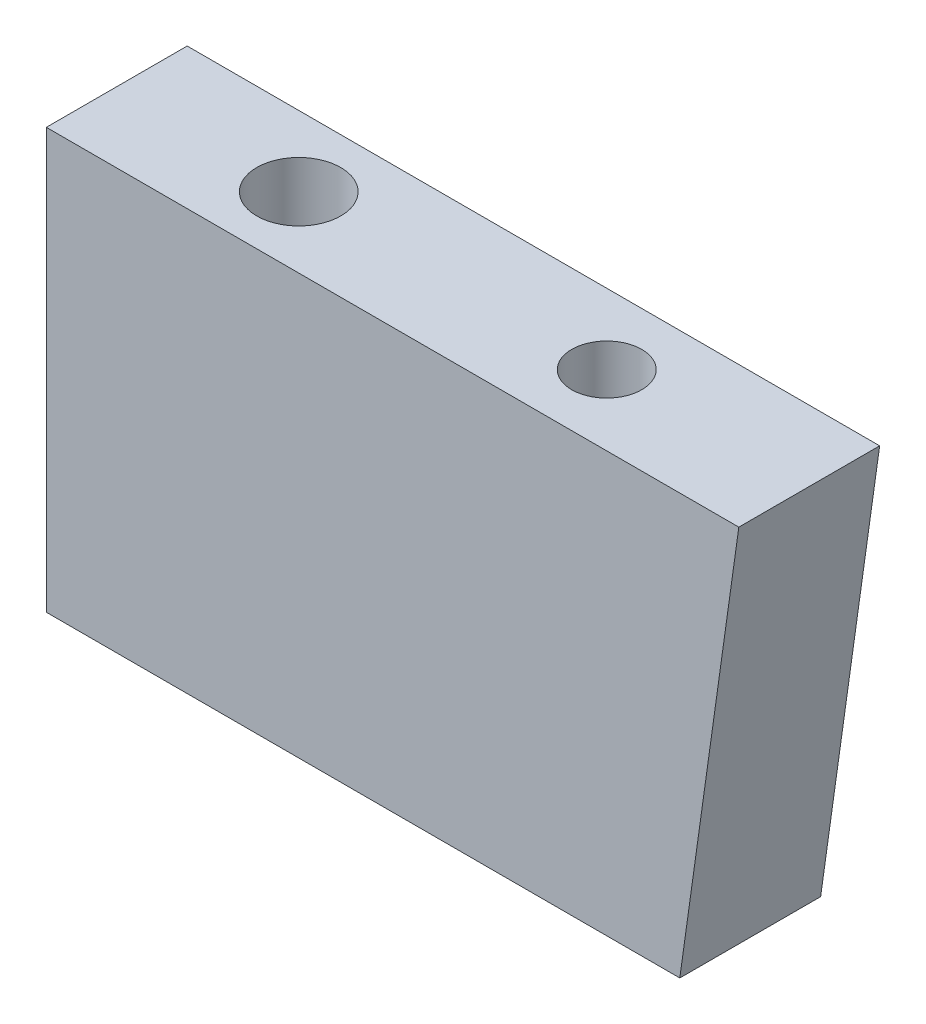
ISO-10303-21;
HEADER;
FILE_DESCRIPTION(('STEP AP214'),'2;1');
FILE_NAME('part.step','',(''),(''),'','','');
FILE_SCHEMA(('AUTOMOTIVE_DESIGN { 1 0 10303 214 1 1 1 1 }'));
ENDSEC;
DATA;
#1=APPLICATION_CONTEXT('core data for automotive mechanical design processes');
#2=APPLICATION_PROTOCOL_DEFINITION('international standard','automotive_design',2000,#1);
#3=PRODUCT_CONTEXT('',#1,'mechanical');
#4=PRODUCT('Part','Part','',(#3));
#5=PRODUCT_RELATED_PRODUCT_CATEGORY('part','',(#4));
#6=PRODUCT_DEFINITION_FORMATION('','',#4);
#7=PRODUCT_DEFINITION_CONTEXT('part definition',#1,'design');
#8=PRODUCT_DEFINITION('design','',#6,#7);
#9=PRODUCT_DEFINITION_SHAPE('','',#8);
#10=(LENGTH_UNIT() NAMED_UNIT(*) SI_UNIT(.MILLI.,.METRE.));
#11=(NAMED_UNIT(*) PLANE_ANGLE_UNIT() SI_UNIT($,.RADIAN.));
#12=(NAMED_UNIT(*) SI_UNIT($,.STERADIAN.) SOLID_ANGLE_UNIT());
#13=UNCERTAINTY_MEASURE_WITH_UNIT(LENGTH_MEASURE(1.E-05),#10,'distance_accuracy_value','');
#14=(GEOMETRIC_REPRESENTATION_CONTEXT(3) GLOBAL_UNCERTAINTY_ASSIGNED_CONTEXT((#13)) GLOBAL_UNIT_ASSIGNED_CONTEXT((#10,
#11,#12)) REPRESENTATION_CONTEXT('',''));
#15=CARTESIAN_POINT('',(0.,0.,0.));
#16=DIRECTION('',(0.,0.,1.));
#17=DIRECTION('',(1.,0.,0.));
#18=AXIS2_PLACEMENT_3D('',#15,#16,#17);
#19=CARTESIAN_POINT('',(29.2324936180977,208.,2.51500000000003));
#20=DIRECTION('',(-0.99026806874159,0.139173100960068,0.));
#21=DIRECTION('',(-0.139173100960066,-0.990268068741571,0.));
#22=AXIS2_PLACEMENT_3D('',#19,#20,#21);
#23=PLANE('',#22);
#24=DIRECTION('',(0.139173100960066,0.990268068741571,0.));
#25=VECTOR('',#24,1.);
#26=CARTESIAN_POINT('',(29.2324936180977,208.,2.51500000000003));
#27=LINE('',#26,#25);
#28=CARTESIAN_POINT('',(27.1243810975619,193.,2.51500000000003));
#29=VERTEX_POINT('',#28);
#30=CARTESIAN_POINT('',(29.2324936180977,208.,2.51500000000003));
#31=VERTEX_POINT('',#30);
#32=EDGE_CURVE('E84',#29,#31,#27,.T.);
#33=ORIENTED_EDGE('',*,*,#32,.F.);
#34=DIRECTION('',(0.,0.,1.00000000000001));
#35=VECTOR('',#34,1.);
#36=CARTESIAN_POINT('',(27.1243810975619,193.,-2.515));
#37=LINE('',#36,#35);
#38=CARTESIAN_POINT('',(27.1243810975619,193.,-2.515));
#39=VERTEX_POINT('',#38);
#40=EDGE_CURVE('E97',#39,#29,#37,.T.);
#41=ORIENTED_EDGE('',*,*,#40,.F.);
#42=DIRECTION('',(0.139173100960066,0.990268068741571,0.));
#43=VECTOR('',#42,1.);
#44=CARTESIAN_POINT('',(29.2324936180977,208.,-2.515));
#45=LINE('',#44,#43);
#46=CARTESIAN_POINT('',(29.2324936180977,208.,-2.515));
#47=VERTEX_POINT('',#46);
#48=EDGE_CURVE('E76',#39,#47,#45,.T.);
#49=ORIENTED_EDGE('',*,*,#48,.T.);
#50=DIRECTION('',(0.,0.,-1.00000000000001));
#51=VECTOR('',#50,1.);
#52=CARTESIAN_POINT('',(29.2324936180977,208.,2.51500000000003));
#53=LINE('',#52,#51);
#54=EDGE_CURVE('E11',#31,#47,#53,.T.);
#55=ORIENTED_EDGE('',*,*,#54,.F.);
#56=EDGE_LOOP('',(#33,#41,#49,#55));
#57=FACE_BOUND('',#56,.T.);
#58=ADVANCED_FACE('F32',(#57),#23,.F.);
#59=CARTESIAN_POINT('',(29.2324936180977,208.,2.51500000000003));
#60=DIRECTION('',(0.,-1.,0.));
#61=DIRECTION('',(0.,0.,-1.00000000000001));
#62=AXIS2_PLACEMENT_3D('',#59,#60,#61);
#63=PLANE('',#62);
#64=CARTESIAN_POINT('',(21.9999999999999,208.,0.));
#65=DIRECTION('',(0.,1.,0.));
#66=DIRECTION('',(0.,0.,1.00000000000001));
#67=AXIS2_PLACEMENT_3D('',#64,#65,#66);
#68=CIRCLE('',#67,1.24999999999999);
#69=CARTESIAN_POINT('',(21.9999999999999,208.,1.25000000000002));
#70=VERTEX_POINT('',#69);
#71=EDGE_CURVE('E113',#70,#70,#68,.T.);
#72=ORIENTED_EDGE('',*,*,#71,.F.);
#73=EDGE_LOOP('',(#72));
#74=FACE_BOUND('',#73,.T.);
#75=CARTESIAN_POINT('',(10.9999999999998,208.,0.));
#76=DIRECTION('',(0.,1.,0.));
#77=DIRECTION('',(0.,0.,1.00000000000001));
#78=AXIS2_PLACEMENT_3D('',#75,#76,#77);
#79=CIRCLE('',#78,1.5);
#80=CARTESIAN_POINT('',(10.9999999999998,208.,1.50000000000006));
#81=VERTEX_POINT('',#80);
#82=EDGE_CURVE('E107',#81,#81,#79,.T.);
#83=ORIENTED_EDGE('',*,*,#82,.F.);
#84=EDGE_LOOP('',(#83));
#85=FACE_BOUND('',#84,.T.);
#86=DIRECTION('',(-1.00000000000002,0.,0.));
#87=VECTOR('',#86,1.);
#88=CARTESIAN_POINT('',(29.2324936180977,208.,-2.515));
#89=LINE('',#88,#87);
#90=CARTESIAN_POINT('',(4.49999999999969,208.,-2.51499999999994));
#91=VERTEX_POINT('',#90);
#92=EDGE_CURVE('E67',#47,#91,#89,.T.);
#93=ORIENTED_EDGE('',*,*,#92,.T.);
#94=DIRECTION('',(0.,0.,-1.00000000000001));
#95=VECTOR('',#94,1.);
#96=CARTESIAN_POINT('',(4.49999999999968,208.,2.51500000000008));
#97=LINE('',#96,#95);
#98=CARTESIAN_POINT('',(4.49999999999968,208.,2.51500000000008));
#99=VERTEX_POINT('',#98);
#100=EDGE_CURVE('E39',#99,#91,#97,.T.);
#101=ORIENTED_EDGE('',*,*,#100,.F.);
#102=DIRECTION('',(-1.00000000000002,0.,0.));
#103=VECTOR('',#102,1.);
#104=CARTESIAN_POINT('',(29.2324936180977,208.,2.51500000000003));
#105=LINE('',#104,#103);
#106=EDGE_CURVE('E55',#31,#99,#105,.T.);
#107=ORIENTED_EDGE('',*,*,#106,.F.);
#108=ORIENTED_EDGE('',*,*,#54,.T.);
#109=EDGE_LOOP('',(#93,#101,#107,#108));
#110=FACE_BOUND('',#109,.T.);
#111=ADVANCED_FACE('F69',(#74,#85,#110),#63,.F.);
#112=CARTESIAN_POINT('',(4.49999999999968,208.,2.51500000000008));
#113=DIRECTION('',(1.00000000000002,0.,0.));
#114=DIRECTION('',(0.,1.,0.));
#115=AXIS2_PLACEMENT_3D('',#112,#113,#114);
#116=PLANE('',#115);
#117=CARTESIAN_POINT('',(4.4999999999997,198.,0.));
#118=DIRECTION('',(-1.00000000000002,0.,0.));
#119=DIRECTION('',(0.,0.,1.00000000000001));
#120=AXIS2_PLACEMENT_3D('',#117,#118,#119);
#121=CIRCLE('',#120,1.5);
#122=CARTESIAN_POINT('',(4.4999999999997,198.,1.50000000000007));
#123=VERTEX_POINT('',#122);
#124=EDGE_CURVE('E89',#123,#123,#121,.T.);
#125=ORIENTED_EDGE('',*,*,#124,.F.);
#126=EDGE_LOOP('',(#125));
#127=FACE_BOUND('',#126,.T.);
#128=DIRECTION('',(0.,-1.,0.));
#129=VECTOR('',#128,1.);
#130=CARTESIAN_POINT('',(4.49999999999969,208.,-2.51499999999994));
#131=LINE('',#130,#129);
#132=CARTESIAN_POINT('',(4.4999999999997,193.,-2.51499999999994));
#133=VERTEX_POINT('',#132);
#134=EDGE_CURVE('E75',#91,#133,#131,.T.);
#135=ORIENTED_EDGE('',*,*,#134,.T.);
#136=DIRECTION('',(0.,0.,1.00000000000001));
#137=VECTOR('',#136,1.);
#138=CARTESIAN_POINT('',(4.4999999999997,193.,-2.51499999999994));
#139=LINE('',#138,#137);
#140=CARTESIAN_POINT('',(4.4999999999997,193.,2.51500000000008));
#141=VERTEX_POINT('',#140);
#142=EDGE_CURVE('E46',#133,#141,#139,.T.);
#143=ORIENTED_EDGE('',*,*,#142,.T.);
#144=DIRECTION('',(0.,-1.,0.));
#145=VECTOR('',#144,1.);
#146=CARTESIAN_POINT('',(4.49999999999968,208.,2.51500000000008));
#147=LINE('',#146,#145);
#148=EDGE_CURVE('E81',#99,#141,#147,.T.);
#149=ORIENTED_EDGE('',*,*,#148,.F.);
#150=ORIENTED_EDGE('',*,*,#100,.T.);
#151=EDGE_LOOP('',(#135,#143,#149,#150));
#152=FACE_BOUND('',#151,.T.);
#153=ADVANCED_FACE('F80',(#127,#152),#116,.F.);
#154=CARTESIAN_POINT('',(0.,0.,2.51500000000001));
#155=DIRECTION('',(0.,0.,1.00000000000001));
#156=DIRECTION('',(1.00000000000002,0.,0.));
#157=AXIS2_PLACEMENT_3D('',#154,#155,#156);
#158=PLANE('',#157);
#159=DIRECTION('',(-1.00000000000002,0.,0.));
#160=VECTOR('',#159,1.);
#161=CARTESIAN_POINT('',(4.4999999999997,193.,2.51500000000008));
#162=LINE('',#161,#160);
#163=EDGE_CURVE('E101',#29,#141,#162,.T.);
#164=ORIENTED_EDGE('',*,*,#163,.F.);
#165=ORIENTED_EDGE('',*,*,#32,.T.);
#166=ORIENTED_EDGE('',*,*,#106,.T.);
#167=ORIENTED_EDGE('',*,*,#148,.T.);
#168=EDGE_LOOP('',(#164,#165,#166,#167));
#169=FACE_BOUND('',#168,.T.);
#170=ADVANCED_FACE('F151',(#169),#158,.T.);
#171=CARTESIAN_POINT('',(0.,0.,-2.51500000000001));
#172=DIRECTION('',(0.,0.,1.00000000000001));
#173=DIRECTION('',(1.00000000000002,0.,0.));
#174=AXIS2_PLACEMENT_3D('',#171,#172,#173);
#175=PLANE('',#174);
#176=ORIENTED_EDGE('',*,*,#48,.F.);
#177=DIRECTION('',(-1.00000000000002,0.,0.));
#178=VECTOR('',#177,1.);
#179=CARTESIAN_POINT('',(4.4999999999997,193.,-2.51499999999994));
#180=LINE('',#179,#178);
#181=EDGE_CURVE('E83',#39,#133,#180,.T.);
#182=ORIENTED_EDGE('',*,*,#181,.T.);
#183=ORIENTED_EDGE('',*,*,#134,.F.);
#184=ORIENTED_EDGE('',*,*,#92,.F.);
#185=EDGE_LOOP('',(#176,#182,#183,#184));
#186=FACE_BOUND('',#185,.T.);
#187=ADVANCED_FACE('F82',(#186),#175,.F.);
#188=CARTESIAN_POINT('',(4.4999999999997,198.,0.));
#189=DIRECTION('',(-1.00000000000002,0.,0.));
#190=DIRECTION('',(0.,0.,1.00000000000001));
#191=AXIS2_PLACEMENT_3D('',#188,#189,#190);
#192=CYLINDRICAL_SURFACE('',#191,1.5);
#193=CARTESIAN_POINT('',(11.9999999999999,198.,0.));
#194=DIRECTION('',(-1.00000000000002,0.,0.));
#195=DIRECTION('',(0.,0.,1.00000000000001));
#196=AXIS2_PLACEMENT_3D('',#193,#194,#195);
#197=CIRCLE('',#196,1.5);
#198=CARTESIAN_POINT('',(11.9999999999999,198.,1.50000000000006));
#199=VERTEX_POINT('',#198);
#200=EDGE_CURVE('E94',#199,#199,#197,.T.);
#201=ORIENTED_EDGE('',*,*,#200,.F.);
#202=EDGE_LOOP('',(#201));
#203=FACE_BOUND('',#202,.T.);
#204=ORIENTED_EDGE('',*,*,#124,.T.);
#205=EDGE_LOOP('',(#204));
#206=FACE_BOUND('',#205,.T.);
#207=ADVANCED_FACE('F159',(#203,#206),#192,.F.);
#208=CARTESIAN_POINT('',(11.9999999999999,198.,0.));
#209=DIRECTION('',(-1.00000000000002,0.,0.));
#210=DIRECTION('',(0.,0.,1.00000000000001));
#211=AXIS2_PLACEMENT_3D('',#208,#209,#210);
#212=CONICAL_SURFACE('',#211,1.5,1.02974425867666);
#213=CARTESIAN_POINT('',(12.9012909285413,198.,0.));
#214=VERTEX_POINT('',#213);
#215=VERTEX_LOOP('',#214);
#216=FACE_BOUND('',#215,.T.);
#217=ORIENTED_EDGE('',*,*,#200,.T.);
#218=EDGE_LOOP('',(#217));
#219=FACE_BOUND('',#218,.T.);
#220=ADVANCED_FACE('F156',(#216,#219),#212,.F.);
#221=CARTESIAN_POINT('',(4.4999999999997,193.,-2.51499999999994));
#222=DIRECTION('',(0.,1.,0.));
#223=DIRECTION('',(0.,0.,1.00000000000001));
#224=AXIS2_PLACEMENT_3D('',#221,#222,#223);
#225=PLANE('',#224);
#226=ORIENTED_EDGE('',*,*,#163,.T.);
#227=ORIENTED_EDGE('',*,*,#142,.F.);
#228=ORIENTED_EDGE('',*,*,#181,.F.);
#229=ORIENTED_EDGE('',*,*,#40,.T.);
#230=EDGE_LOOP('',(#226,#227,#228,#229));
#231=FACE_BOUND('',#230,.T.);
#232=ADVANCED_FACE('F135',(#231),#225,.F.);
#233=CARTESIAN_POINT('',(10.9999999999998,200.5,0.));
#234=DIRECTION('',(0.,1.,0.));
#235=DIRECTION('',(0.,0.,1.00000000000001));
#236=AXIS2_PLACEMENT_3D('',#233,#234,#235);
#237=CONICAL_SURFACE('',#236,1.5,1.02974425867666);
#238=CARTESIAN_POINT('',(10.9999999999998,199.598709071459,0.));
#239=VERTEX_POINT('',#238);
#240=VERTEX_LOOP('',#239);
#241=FACE_BOUND('',#240,.T.);
#242=CARTESIAN_POINT('',(10.9999999999998,200.5,0.));
#243=DIRECTION('',(0.,1.,0.));
#244=DIRECTION('',(0.,0.,1.00000000000001));
#245=AXIS2_PLACEMENT_3D('',#242,#243,#244);
#246=CIRCLE('',#245,1.5);
#247=CARTESIAN_POINT('',(10.9999999999998,200.5,1.50000000000006));
#248=VERTEX_POINT('',#247);
#249=EDGE_CURVE('E103',#248,#248,#246,.T.);
#250=ORIENTED_EDGE('',*,*,#249,.T.);
#251=EDGE_LOOP('',(#250));
#252=FACE_BOUND('',#251,.T.);
#253=ADVANCED_FACE('F126',(#241,#252),#237,.F.);
#254=CARTESIAN_POINT('',(10.9999999999998,208.,0.));
#255=DIRECTION('',(0.,1.,0.));
#256=DIRECTION('',(0.,0.,1.00000000000001));
#257=AXIS2_PLACEMENT_3D('',#254,#255,#256);
#258=CYLINDRICAL_SURFACE('',#257,1.5);
#259=ORIENTED_EDGE('',*,*,#249,.F.);
#260=EDGE_LOOP('',(#259));
#261=FACE_BOUND('',#260,.T.);
#262=ORIENTED_EDGE('',*,*,#82,.T.);
#263=EDGE_LOOP('',(#262));
#264=FACE_BOUND('',#263,.T.);
#265=ADVANCED_FACE('F123',(#261,#264),#258,.F.);
#266=CARTESIAN_POINT('',(22.,202.,0.));
#267=DIRECTION('',(0.,1.,0.));
#268=DIRECTION('',(0.,0.,1.00000000000001));
#269=AXIS2_PLACEMENT_3D('',#266,#267,#268);
#270=CONICAL_SURFACE('',#269,1.24999999999999,1.02974425867666);
#271=CARTESIAN_POINT('',(21.9999999999999,201.248924226216,0.));
#272=VERTEX_POINT('',#271);
#273=VERTEX_LOOP('',#272);
#274=FACE_BOUND('',#273,.T.);
#275=CARTESIAN_POINT('',(22.,202.,0.));
#276=DIRECTION('',(0.,1.,0.));
#277=DIRECTION('',(0.,0.,1.00000000000001));
#278=AXIS2_PLACEMENT_3D('',#275,#276,#277);
#279=CIRCLE('',#278,1.24999999999999);
#280=CARTESIAN_POINT('',(21.9999999999999,202.,1.25000000000002));
#281=VERTEX_POINT('',#280);
#282=EDGE_CURVE('E110',#281,#281,#279,.T.);
#283=ORIENTED_EDGE('',*,*,#282,.T.);
#284=EDGE_LOOP('',(#283));
#285=FACE_BOUND('',#284,.T.);
#286=ADVANCED_FACE('F125',(#274,#285),#270,.F.);
#287=CARTESIAN_POINT('',(21.9999999999999,208.,0.));
#288=DIRECTION('',(0.,1.,0.));
#289=DIRECTION('',(0.,0.,1.00000000000001));
#290=AXIS2_PLACEMENT_3D('',#287,#288,#289);
#291=CYLINDRICAL_SURFACE('',#290,1.24999999999999);
#292=ORIENTED_EDGE('',*,*,#282,.F.);
#293=EDGE_LOOP('',(#292));
#294=FACE_BOUND('',#293,.T.);
#295=ORIENTED_EDGE('',*,*,#71,.T.);
#296=EDGE_LOOP('',(#295));
#297=FACE_BOUND('',#296,.T.);
#298=ADVANCED_FACE('F117',(#294,#297),#291,.F.);
#299=CLOSED_SHELL('',(#58,#111,#153,#170,#187,#207,#220,#232,#253,#265,#286,#298));
#300=MANIFOLD_SOLID_BREP('B2',#299);
#301=ADVANCED_BREP_SHAPE_REPRESENTATION('',(#18,#300),#14);
#302=SHAPE_DEFINITION_REPRESENTATION(#9,#301);
ENDSEC;
END-ISO-10303-21;
